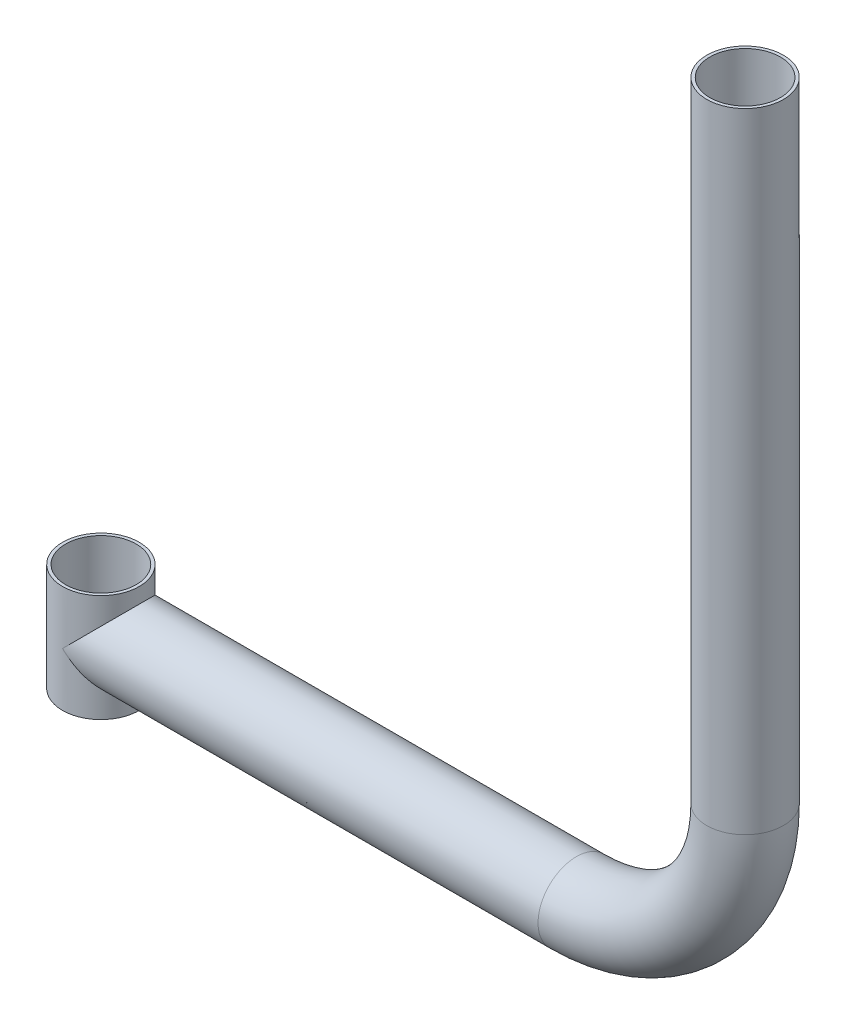
ISO-10303-21;
HEADER;
FILE_DESCRIPTION(('STEP AP214'),'2;1');
FILE_NAME('part.step','',(''),(''),'','','');
FILE_SCHEMA(('AUTOMOTIVE_DESIGN { 1 0 10303 214 1 1 1 1 }'));
ENDSEC;
DATA;
#1=APPLICATION_CONTEXT('core data for automotive mechanical design processes');
#2=APPLICATION_PROTOCOL_DEFINITION('international standard','automotive_design',2000,#1);
#3=PRODUCT_CONTEXT('',#1,'mechanical');
#4=PRODUCT('Part','Part','',(#3));
#5=PRODUCT_RELATED_PRODUCT_CATEGORY('part','',(#4));
#6=PRODUCT_DEFINITION_FORMATION('','',#4);
#7=PRODUCT_DEFINITION_CONTEXT('part definition',#1,'design');
#8=PRODUCT_DEFINITION('design','',#6,#7);
#9=PRODUCT_DEFINITION_SHAPE('','',#8);
#10=(LENGTH_UNIT() NAMED_UNIT(*) SI_UNIT(.MILLI.,.METRE.));
#11=(NAMED_UNIT(*) PLANE_ANGLE_UNIT() SI_UNIT($,.RADIAN.));
#12=(NAMED_UNIT(*) SI_UNIT($,.STERADIAN.) SOLID_ANGLE_UNIT());
#13=UNCERTAINTY_MEASURE_WITH_UNIT(LENGTH_MEASURE(1.E-05),#10,'distance_accuracy_value','');
#14=(GEOMETRIC_REPRESENTATION_CONTEXT(3) GLOBAL_UNCERTAINTY_ASSIGNED_CONTEXT((#13)) GLOBAL_UNIT_ASSIGNED_CONTEXT((#10,
#11,#12)) REPRESENTATION_CONTEXT('',''));
#15=CARTESIAN_POINT('',(0.,0.,0.));
#16=DIRECTION('',(0.,0.,1.));
#17=DIRECTION('',(1.,0.,0.));
#18=AXIS2_PLACEMENT_3D('',#15,#16,#17);
#19=CARTESIAN_POINT('',(0.,17.5,0.));
#20=DIRECTION('',(0.,-1.,0.));
#21=DIRECTION('',(0.,0.,-1.));
#22=AXIS2_PLACEMENT_3D('',#19,#20,#21);
#23=CYLINDRICAL_SURFACE('',#22,12.5);
#24=CARTESIAN_POINT('',(0.,-17.5,0.));
#25=DIRECTION('',(0.,1.,0.));
#26=DIRECTION('',(0.,0.,1.));
#27=AXIS2_PLACEMENT_3D('',#24,#25,#26);
#28=CIRCLE('',#27,12.5);
#29=CARTESIAN_POINT('',(0.,-17.5,12.5));
#30=VERTEX_POINT('',#29);
#31=EDGE_CURVE('E37',#30,#30,#28,.T.);
#32=ORIENTED_EDGE('',*,*,#31,.T.);
#33=EDGE_LOOP('',(#32));
#34=FACE_BOUND('',#33,.T.);
#35=CARTESIAN_POINT('',(0.,17.5,0.));
#36=DIRECTION('',(0.,1.,0.));
#37=DIRECTION('',(0.,0.,1.));
#38=AXIS2_PLACEMENT_3D('',#35,#36,#37);
#39=CIRCLE('',#38,12.5);
#40=CARTESIAN_POINT('',(0.,17.5,12.5));
#41=VERTEX_POINT('',#40);
#42=EDGE_CURVE('E11',#41,#41,#39,.T.);
#43=ORIENTED_EDGE('',*,*,#42,.F.);
#44=EDGE_LOOP('',(#43));
#45=FACE_BOUND('',#44,.T.);
#46=CARTESIAN_POINT('',(0.,0.,0.));
#47=DIRECTION('',(-0.707106781186547,-0.707106781186547,0.));
#48=DIRECTION('',(0.707106781186547,-0.707106781186547,0.));
#49=AXIS2_PLACEMENT_3D('',#46,#47,#48);
#50=ELLIPSE('',#49,17.6776695296637,12.5);
#51=CARTESIAN_POINT('',(0.,0.,12.5));
#52=VERTEX_POINT('',#51);
#53=CARTESIAN_POINT('',(0.,0.,-12.5));
#54=VERTEX_POINT('',#53);
#55=EDGE_CURVE('E49',#52,#54,#50,.F.);
#56=ORIENTED_EDGE('',*,*,#55,.F.);
#57=CARTESIAN_POINT('',(0.,0.,0.));
#58=DIRECTION('',(0.707106781186547,-0.707106781186547,0.));
#59=DIRECTION('',(-0.707106781186547,-0.707106781186547,0.));
#60=AXIS2_PLACEMENT_3D('',#57,#58,#59);
#61=ELLIPSE('',#60,17.6776695296637,12.5);
#62=EDGE_CURVE('E47',#54,#52,#61,.T.);
#63=ORIENTED_EDGE('',*,*,#62,.F.);
#64=EDGE_LOOP('',(#56,#63));
#65=FACE_BOUND('',#64,.T.);
#66=ADVANCED_FACE('F32',(#34,#45,#65),#23,.T.);
#67=CARTESIAN_POINT('',(0.,17.5,0.));
#68=DIRECTION('',(0.,1.,0.));
#69=DIRECTION('',(0.,0.,1.));
#70=AXIS2_PLACEMENT_3D('',#67,#68,#69);
#71=PLANE('',#70);
#72=ORIENTED_EDGE('',*,*,#42,.T.);
#73=EDGE_LOOP('',(#72));
#74=FACE_BOUND('',#73,.T.);
#75=CARTESIAN_POINT('',(0.,17.5,0.));
#76=DIRECTION('',(0.,1.,0.));
#77=DIRECTION('',(0.,0.,1.));
#78=AXIS2_PLACEMENT_3D('',#75,#76,#77);
#79=CIRCLE('',#78,11.5);
#80=CARTESIAN_POINT('',(0.,17.5,11.5));
#81=VERTEX_POINT('',#80);
#82=EDGE_CURVE('E67',#81,#81,#79,.T.);
#83=ORIENTED_EDGE('',*,*,#82,.F.);
#84=EDGE_LOOP('',(#83));
#85=FACE_BOUND('',#84,.T.);
#86=ADVANCED_FACE('F98',(#74,#85),#71,.T.);
#87=CARTESIAN_POINT('',(0.,-17.5,0.));
#88=DIRECTION('',(0.,1.,0.));
#89=DIRECTION('',(0.,0.,1.));
#90=AXIS2_PLACEMENT_3D('',#87,#88,#89);
#91=PLANE('',#90);
#92=ORIENTED_EDGE('',*,*,#31,.F.);
#93=EDGE_LOOP('',(#92));
#94=FACE_BOUND('',#93,.T.);
#95=CARTESIAN_POINT('',(0.,-17.5,0.));
#96=DIRECTION('',(0.,1.,0.));
#97=DIRECTION('',(0.,0.,1.));
#98=AXIS2_PLACEMENT_3D('',#95,#96,#97);
#99=CIRCLE('',#98,11.5);
#100=CARTESIAN_POINT('',(0.,-17.5,11.5));
#101=VERTEX_POINT('',#100);
#102=EDGE_CURVE('E66',#101,#101,#99,.T.);
#103=ORIENTED_EDGE('',*,*,#102,.T.);
#104=EDGE_LOOP('',(#103));
#105=FACE_BOUND('',#104,.T.);
#106=ADVANCED_FACE('F74',(#94,#105),#91,.F.);
#107=CARTESIAN_POINT('',(155.,0.,0.));
#108=DIRECTION('',(-1.,0.,0.));
#109=DIRECTION('',(0.,0.,1.));
#110=AXIS2_PLACEMENT_3D('',#107,#108,#109);
#111=CYLINDRICAL_SURFACE('',#110,11.5);
#112=CARTESIAN_POINT('',(155.,0.,0.));
#113=DIRECTION('',(1.,0.,0.));
#114=DIRECTION('',(0.,0.,-1.));
#115=AXIS2_PLACEMENT_3D('',#112,#113,#114);
#116=CIRCLE('',#115,11.5);
#117=CARTESIAN_POINT('',(154.999999999999,-11.5,0.));
#118=VERTEX_POINT('',#117);
#119=EDGE_CURVE('E139',#118,#118,#116,.T.);
#120=ORIENTED_EDGE('',*,*,#119,.T.);
#121=EDGE_LOOP('',(#120));
#122=FACE_BOUND('',#121,.T.);
#123=CARTESIAN_POINT('',(4.89897948556636,0.,11.5));
#124=CARTESIAN_POINT('',(4.89898687547073,-0.161050714941098,11.499998128947));
#125=CARTESIAN_POINT('',(4.90697813966694,-0.322176004963235,11.4966027371293));
#126=CARTESIAN_POINT('',(4.93837620325656,-0.642708575727259,11.4831491725606));
#127=CARTESIAN_POINT('',(4.96179691291249,-0.802114174173734,11.4730849875782));
#128=CARTESIAN_POINT('',(5.02259742005674,-1.11833648788955,11.4465980320316));
#129=CARTESIAN_POINT('',(5.06003347340364,-1.27514007373364,11.430149626083));
#130=CARTESIAN_POINT('',(5.14676681097267,-1.58471517798801,11.3913583865481));
#131=CARTESIAN_POINT('',(5.19607105766288,-1.73748427096921,11.3690120922243));
#132=CARTESIAN_POINT('',(5.33227309215398,-2.11625704291806,11.3059715642967));
#133=CARTESIAN_POINT('',(5.42544724047777,-2.33940997190162,11.2617576276176));
#134=CARTESIAN_POINT('',(5.62744991669083,-2.77591364007455,11.1621908304903));
#135=CARTESIAN_POINT('',(5.73629055737224,-2.98925662457986,11.1068293378006));
#136=CARTESIAN_POINT('',(5.96502867597921,-3.40768576295589,10.9856836116672));
#137=CARTESIAN_POINT('',(6.08495897623642,-3.61274464631825,10.9198679956927));
#138=CARTESIAN_POINT('',(6.33200766115236,-4.01490639968847,10.7784946043585));
#139=CARTESIAN_POINT('',(6.45912469685261,-4.21201075094599,10.7029386538847));
#140=CARTESIAN_POINT('',(6.707415470669,-4.58332454200366,10.5489406338149));
#141=CARTESIAN_POINT('',(6.82822463697599,-4.75808781043085,10.4712403790351));
#142=CARTESIAN_POINT('',(7.07229253111596,-5.10215445451722,10.3079709264145));
#143=CARTESIAN_POINT('',(7.19555158478182,-5.27145709595743,10.2224006763069));
#144=CARTESIAN_POINT('',(7.56732196696402,-5.77187771249151,9.95384278397825));
#145=CARTESIAN_POINT('',(7.81772767084005,-6.09536428222405,9.75906809975432));
#146=CARTESIAN_POINT('',(8.31597592337605,-6.72245115016219,9.33814656598695));
#147=CARTESIAN_POINT('',(8.56382117893503,-7.02607476524667,9.11203750886328));
#148=CARTESIAN_POINT('',(9.05165796215988,-7.61308864696441,8.62760439001121));
#149=CARTESIAN_POINT('',(9.29165369583881,-7.89648984887659,8.36929794982774));
#150=CARTESIAN_POINT('',(9.69944261344901,-8.37197840839213,7.88944124621889));
#151=CARTESIAN_POINT('',(9.87010734353275,-8.56899215672874,7.67519003088859));
#152=CARTESIAN_POINT('',(10.202094641417,-8.94937798788239,7.22805483312078));
#153=CARTESIAN_POINT('',(10.3634172919888,-9.13275019156844,6.9951710158128));
#154=CARTESIAN_POINT('',(10.6741870295864,-9.48393038355601,6.51109436548971));
#155=CARTESIAN_POINT('',(10.8236505788622,-9.6517600034736,6.25992787500952));
#156=CARTESIAN_POINT('',(11.1084865019469,-9.97013177413841,5.73929556202502));
#157=CARTESIAN_POINT('',(11.2438620374257,-10.1206778045013,5.46983386790782));
#158=CARTESIAN_POINT('',(11.4721984543046,-10.3737008945038,4.96972646273325));
#159=CARTESIAN_POINT('',(11.568198005625,-10.4797395753268,4.74226476946735));
#160=CARTESIAN_POINT('',(11.7482113699604,-10.6781182124875,4.27688451652436));
#161=CARTESIAN_POINT('',(11.8322278277428,-10.770461191759,4.03896827946154));
#162=CARTESIAN_POINT('',(11.986910530654,-10.9401664397766,3.55370238867579));
#163=CARTESIAN_POINT('',(12.0575809495177,-11.017533392197,3.30635571333425));
#164=CARTESIAN_POINT('',(12.1843204403249,-11.156094705046,2.80349019348776));
#165=CARTESIAN_POINT('',(12.2403893540418,-11.2172888902215,2.54797126045937));
#166=CARTESIAN_POINT('',(12.3371204858404,-11.3227641256212,2.02871018877128));
#167=CARTESIAN_POINT('',(12.3776756184755,-11.3669276362021,1.76492402766838));
#168=CARTESIAN_POINT('',(12.4419371340211,-11.43686979282,1.23287897056051));
#169=CARTESIAN_POINT('',(12.4656434703678,-11.4626483880478,0.964620062196632));
#170=CARTESIAN_POINT('',(12.495645990742,-11.4952690165045,0.426073463036318));
#171=CARTESIAN_POINT('',(12.5019482947592,-11.502117706285,0.155786518915252));
#172=CARTESIAN_POINT('',(12.497006192477,-11.4967458624833,-0.384422796799358));
#173=CARTESIAN_POINT('',(12.4857632352727,-11.4845269037328,-0.654345196658472));
#174=CARTESIAN_POINT('',(12.4481528354092,-11.4436254856433,-1.1624273349759));
#175=CARTESIAN_POINT('',(12.4235450357872,-11.4168582309481,-1.40087651423709));
#176=CARTESIAN_POINT('',(12.3610430170978,-11.3488134031408,-1.87390516554496));
#177=CARTESIAN_POINT('',(12.3231499589664,-11.3075370979052,-2.10848497384287));
#178=CARTESIAN_POINT('',(12.2347354521912,-11.2111159671172,-2.57235513712152));
#179=CARTESIAN_POINT('',(12.1842130036516,-11.1559700434753,-2.80164507172086));
#180=CARTESIAN_POINT('',(12.0713591688217,-11.0326031737016,-3.25370120963636));
#181=CARTESIAN_POINT('',(12.0090270912403,-10.9643814621599,-3.47646703017375));
#182=CARTESIAN_POINT('',(11.8705807408609,-10.8125713078652,-3.92383200811826));
#183=CARTESIAN_POINT('',(11.7939915011827,-10.7284509621474,-4.14810304529409));
#184=CARTESIAN_POINT('',(11.6300610807104,-10.5479735344468,-4.58767171451829));
#185=CARTESIAN_POINT('',(11.5427164497142,-10.4516125254896,-4.80296643726919));
#186=CARTESIAN_POINT('',(11.3584062181262,-10.2476971127943,-5.22392642907384));
#187=CARTESIAN_POINT('',(11.261439767047,-10.1401417195264,-5.42959084452084));
#188=CARTESIAN_POINT('',(11.0589931923798,-9.91482593179784,-5.83088305795222));
#189=CARTESIAN_POINT('',(10.953512123444,-9.79706440407912,-6.02650973752764));
#190=CARTESIAN_POINT('',(10.6776085306931,-9.48780644512488,-6.50776096124053));
#191=CARTESIAN_POINT('',(10.5022149153422,-9.29011163816472,-6.7865890268831));
#192=CARTESIAN_POINT('',(10.1376201357452,-8.87586730438183,-7.32004803092958));
#193=CARTESIAN_POINT('',(9.94841707388713,-8.65931518550715,-7.57467563274051));
#194=CARTESIAN_POINT('',(9.55891227170324,-8.20887672790055,-8.06067222124523));
#195=CARTESIAN_POINT('',(9.35857962638402,-7.97494144265216,-8.29197084908409));
#196=CARTESIAN_POINT('',(8.95054525301139,-7.49192811234575,-8.73083579864401));
#197=CARTESIAN_POINT('',(8.74284487727575,-7.24285284024494,-8.93840644631062));
#198=CARTESIAN_POINT('',(8.31806142484458,-6.72405590760965,-9.33522279099068));
#199=CARTESIAN_POINT('',(8.1008734225098,-6.45397521683364,-9.52388570495906));
#200=CARTESIAN_POINT('',(7.66592878136406,-5.89884032510975,-9.8773500349799));
#201=CARTESIAN_POINT('',(7.44817194540539,-5.61378001091634,-10.0421416043458));
#202=CARTESIAN_POINT('',(7.01768541742546,-5.02863648875022,-10.3475364573665));
#203=CARTESIAN_POINT('',(6.80494444090452,-4.72859294427691,-10.4881996427082));
#204=CARTESIAN_POINT('',(6.39112200466379,-4.11087361697843,-10.7453547183043));
#205=CARTESIAN_POINT('',(6.19002952446975,-3.79321507549507,-10.8618697330784));
#206=CARTESIAN_POINT('',(5.83810792419264,-3.18371962110321,-11.0544453529163));
#207=CARTESIAN_POINT('',(5.68421267924375,-2.89476796631387,-11.1339170724581));
#208=CARTESIAN_POINT('',(5.40499287174953,-2.29854308748267,-11.2720982029706));
#209=CARTESIAN_POINT('',(5.27963024618152,-1.99129497024341,-11.3308353326125));
#210=CARTESIAN_POINT('',(5.09287423096793,-1.4133985350198,-11.415844125629));
#211=CARTESIAN_POINT('',(5.02410089051111,-1.14584259189194,-11.4460130027346));
#212=CARTESIAN_POINT('',(4.95247276201405,-0.738225702055074,-11.4770921434419));
#213=CARTESIAN_POINT('',(4.93385419026909,-0.601410375894931,-11.4850888020826));
#214=CARTESIAN_POINT('',(4.90794414368101,-0.326487474449195,-11.4961863057685));
#215=CARTESIAN_POINT('',(4.90065211800655,-0.188379962333682,-11.4992873888948));
#216=CARTESIAN_POINT('',(4.89781609621938,0.0884821772971746,-11.5004956679116));
#217=CARTESIAN_POINT('',(4.90231474860417,0.227237336804015,-11.4985847346345));
#218=CARTESIAN_POINT('',(4.92287050908509,0.503697212373779,-11.4897978680586));
#219=CARTESIAN_POINT('',(4.93892803265257,0.641401890498459,-11.4829217562918));
#220=CARTESIAN_POINT('',(5.0033743321431,1.05193755174673,-11.4550655719315));
#221=CARTESIAN_POINT('',(5.06803728544576,1.3218297760185,-11.4268567940886));
#222=CARTESIAN_POINT('',(5.21149593035029,1.78813018458343,-11.3619931611251));
#223=CARTESIAN_POINT('',(5.28366715870774,1.98721614504941,-11.3287503263076));
#224=CARTESIAN_POINT('',(5.44263143335629,2.3778132194689,-11.2532451251904));
#225=CARTESIAN_POINT('',(5.52943458144902,2.56931898652808,-11.2109765221314));
#226=CARTESIAN_POINT('',(5.71399448175805,2.94563320809442,-11.1180472586453));
#227=CARTESIAN_POINT('',(5.81178834041665,3.13041600638476,-11.067357875138));
#228=CARTESIAN_POINT('',(6.01507472283465,3.49338123328425,-10.9582025067598));
#229=CARTESIAN_POINT('',(6.12057015763763,3.67156112736004,-10.8997335744326));
#230=CARTESIAN_POINT('',(6.33639866038959,4.02103743234971,-10.7756886421296));
#231=CARTESIAN_POINT('',(6.44670436225923,4.19236427189973,-10.7101503441168));
#232=CARTESIAN_POINT('',(6.67098309654928,4.52966096540773,-10.5719143056716));
#233=CARTESIAN_POINT('',(6.78495677588085,4.69562986394612,-10.4992152976139));
#234=CARTESIAN_POINT('',(7.13050195603415,5.1863670598243,-10.2704484627847));
#235=CARTESIAN_POINT('',(7.36558503462184,5.50378925727005,-10.1037741085232));
#236=CARTESIAN_POINT('',(7.83738405429405,6.12076532297191,-9.74237742866567));
#237=CARTESIAN_POINT('',(8.07409982094008,6.42032106809488,-9.54765805655716));
#238=CARTESIAN_POINT('',(8.54377930372247,7.00182133319181,-9.12976396653465));
#239=CARTESIAN_POINT('',(8.77674473671805,7.28377409218957,-8.90660271178787));
#240=CARTESIAN_POINT('',(9.19972720833235,7.78785763418102,-8.46719771040084));
#241=CARTESIAN_POINT('',(9.39090116423714,8.01257750923726,-8.25503390492284));
#242=CARTESIAN_POINT('',(9.76469738674804,8.44758518267198,-7.80930685823016));
#243=CARTESIAN_POINT('',(9.94731902963564,8.65787192896433,-7.57574205990647));
#244=CARTESIAN_POINT('',(10.3009403926557,9.061947757436,-7.08740871318655));
#245=CARTESIAN_POINT('',(10.4719596814031,9.25576476449016,-6.83267756485498));
#246=CARTESIAN_POINT('',(10.7997829916574,9.62509952596485,-6.30174148200565));
#247=CARTESIAN_POINT('',(10.9565922258827,9.80062399426815,-6.02554449150241));
#248=CARTESIAN_POINT('',(11.2179817515655,10.0918879654816,-5.51975922373696));
#249=CARTESIAN_POINT('',(11.3261627721092,10.2119695431636,-5.29452222302423));
#250=CARTESIAN_POINT('',(11.5309056463323,10.4385892067585,-4.83239356415985));
#251=CARTESIAN_POINT('',(11.6274741689099,10.545135068052,-4.59550870641291));
#252=CARTESIAN_POINT('',(11.8075486654861,10.7433664110982,-4.11079388358198));
#253=CARTESIAN_POINT('',(11.8910555453675,10.8350529234286,-3.86296467906701));
#254=CARTESIAN_POINT('',(12.0435383268843,11.0021809634364,-3.35750733945077));
#255=CARTESIAN_POINT('',(12.1125140256028,11.0776222642619,-3.09987906757223));
#256=CARTESIAN_POINT('',(12.2350544415523,11.2114802371808,-2.57426529928759));
#257=CARTESIAN_POINT('',(12.2884887959589,11.2697529468644,-2.30621243615065));
#258=CARTESIAN_POINT('',(12.3779880039751,11.3672759598111,-1.76379030075867));
#259=CARTESIAN_POINT('',(12.4140528058244,11.4065262063886,-1.48942100968363));
#260=CARTESIAN_POINT('',(12.4679238735094,11.4651323139446,-0.936941815429361));
#261=CARTESIAN_POINT('',(12.4857408371337,11.4844998311819,-0.658834200845877));
#262=CARTESIAN_POINT('',(12.5026975752214,11.5029326980903,-0.101393211070279));
#263=CARTESIAN_POINT('',(12.5018395179428,11.5020004046653,0.177940018057065));
#264=CARTESIAN_POINT('',(12.4827672929756,11.4812669563771,0.699925113261697));
#265=CARTESIAN_POINT('',(12.4667562048329,11.463860891734,0.942759167618235));
#266=CARTESIAN_POINT('',(12.4208172420688,11.4138862017807,1.42550769397818));
#267=CARTESIAN_POINT('',(12.3908907818161,11.3813191174472,1.66542246015768));
#268=CARTESIAN_POINT('',(12.3176744816862,11.3015642393651,2.1407307991588));
#269=CARTESIAN_POINT('',(12.2743841551395,11.2543759131571,2.37612420699529));
#270=CARTESIAN_POINT('',(12.1751933112679,11.1461115432759,2.84097860156579));
#271=CARTESIAN_POINT('',(12.1192921531647,11.0850347939066,3.07043928618725));
#272=CARTESIAN_POINT('',(11.994964578962,10.9489702408972,3.52521321342218));
#273=CARTESIAN_POINT('',(11.9263831073054,10.8738100517616,3.75043222445788));
#274=CARTESIAN_POINT('',(11.7781931330006,10.7110674028921,4.19268210703811));
#275=CARTESIAN_POINT('',(11.6985804177752,10.6234801972601,4.40970981003325));
#276=CARTESIAN_POINT('',(11.529402669621,10.4368901300052,4.83479134974706));
#277=CARTESIAN_POINT('',(11.4398369855933,10.3378865215334,5.04284459814165));
#278=CARTESIAN_POINT('',(11.251808535832,10.1294234255294,5.44949658673558));
#279=CARTESIAN_POINT('',(11.1533438885123,10.0199617264702,5.64809331384212));
#280=CARTESIAN_POINT('',(10.8977870789843,9.73486093567296,6.13152420975689));
#281=CARTESIAN_POINT('',(10.7358214621247,9.55330754529369,6.41032549853229));
#282=CARTESIAN_POINT('',(10.3975531977266,9.17152955735848,6.94558987822857));
#283=CARTESIAN_POINT('',(10.221244522879,8.97129710515767,7.20204348336036));
#284=CARTESIAN_POINT('',(9.85698826790956,8.55398269579396,7.69307546008197));
#285=CARTESIAN_POINT('',(9.66901737839877,8.33686675878136,7.92760750925563));
#286=CARTESIAN_POINT('',(9.28467936161992,7.88788655528294,8.37445922765048));
#287=CARTESIAN_POINT('',(9.0883133918574,7.65602431986653,8.58678194524771));
#288=CARTESIAN_POINT('',(8.68531819020779,7.17306839441962,8.99440298928941));
#289=CARTESIAN_POINT('',(8.47855628735832,6.9216513896794,9.18918585732347));
#290=CARTESIAN_POINT('',(8.06232759553174,6.40504511225322,9.55645791294846));
#291=CARTESIAN_POINT('',(7.85286020695987,6.13985274588527,9.72894206206572));
#292=CARTESIAN_POINT('',(7.43528061619216,5.59587261598335,10.0516734566371));
#293=CARTESIAN_POINT('',(7.22716710435726,5.31710130033501,10.2019467568244));
#294=CARTESIAN_POINT('',(6.81697912916304,4.74461044073653,10.4804601816031));
#295=CARTESIAN_POINT('',(6.61490162206504,4.45089863983587,10.6087115714535));
#296=CARTESIAN_POINT('',(6.31626579520195,3.98872406967352,10.7874628753249));
#297=CARTESIAN_POINT('',(6.21487970930982,3.82650251548467,10.8461106406693));
#298=CARTESIAN_POINT('',(6.01742809739356,3.49670403918121,10.9568856156582));
#299=CARTESIAN_POINT('',(5.92136141916834,3.32912828930238,11.0090142404727));
#300=CARTESIAN_POINT('',(5.73656621153711,2.98809235522164,11.1064265952979));
#301=CARTESIAN_POINT('',(5.64783419342118,2.81463502459067,11.1517135880939));
#302=CARTESIAN_POINT('',(5.48033591286551,2.46136439338965,11.2349750932121));
#303=CARTESIAN_POINT('',(5.40156634983256,2.28155322325912,11.2729520295672));
#304=CARTESIAN_POINT('',(5.22216722851541,1.82578964665572,11.3575094376127));
#305=CARTESIAN_POINT('',(5.12950352372435,1.54556137013475,11.3993091164748));
#306=CARTESIAN_POINT('',(5.02259951530565,1.11610771523456,11.4466161892325));
#307=CARTESIAN_POINT('',(4.99233324186775,0.971644178288444,11.4598121352095));
#308=CARTESIAN_POINT('',(4.94391681635751,0.680344096791332,11.480783646627));
#309=CARTESIAN_POINT('',(4.92575721115924,0.533509495592051,11.4885634413159));
#310=CARTESIAN_POINT('',(4.90912520612383,0.321909516480606,11.4956736718879));
#311=CARTESIAN_POINT('',(4.90532606575551,0.257600504845143,11.4972946830357));
#312=CARTESIAN_POINT('',(4.90025171262072,0.128864975946772,11.499458227586));
#313=CARTESIAN_POINT('',(4.89897652877081,0.0644384573460696,11.5000007486323));
#314=CARTESIAN_POINT('',(4.89897948556636,0.,11.5));
#315=B_SPLINE_CURVE_WITH_KNOTS('',3,(#123,#124,#125,#126,#127,#128,#129,#130,#131,#132,#133,
#134,#135,#136,#137,#138,#139,#140,#141,#142,#143,#144,#145,#146,#147,#148,#149,#150,#151,#152,
#153,#154,#155,#156,#157,#158,#159,#160,#161,#162,#163,#164,#165,#166,#167,#168,#169,#170,#171,
#172,#173,#174,#175,#176,#177,#178,#179,#180,#181,#182,#183,#184,#185,#186,#187,#188,#189,#190,
#191,#192,#193,#194,#195,#196,#197,#198,#199,#200,#201,#202,#203,#204,#205,#206,#207,#208,#209,
#210,#211,#212,#213,#214,#215,#216,#217,#218,#219,#220,#221,#222,#223,#224,#225,#226,#227,#228,
#229,#230,#231,#232,#233,#234,#235,#236,#237,#238,#239,#240,#241,#242,#243,#244,#245,#246,#247,
#248,#249,#250,#251,#252,#253,#254,#255,#256,#257,#258,#259,#260,#261,#262,#263,#264,#265,#266,
#267,#268,#269,#270,#271,#272,#273,#274,#275,#276,#277,#278,#279,#280,#281,#282,#283,#284,#285,
#286,#287,#288,#289,#290,#291,#292,#293,#294,#295,#296,#297,#298,#299,#300,#301,#302,#303,#304,
#305,#306,#307,#308,#309,#310,#311,#312,#313,#314),.UNSPECIFIED.,.T.,.F.,(4,2,2,2,2,2,2,2,2,2,2,
2,2,2,2,2,2,2,2,2,2,2,2,2,2,2,2,2,2,2,2,2,2,2,2,2,2,2,2,2,2,2,2,2,2,2,2,2,2,2,2,2,2,2,2,2,2,2,2,
2,2,2,2,2,2,2,2,2,2,2,2,2,2,2,2,2,2,2,2,2,2,2,2,2,2,2,2,2,2,2,2,2,2,2,2,4),(0.,0.48305742701083,
0.966550946680514,1.45200632705651,1.93774719658965,2.67392368998395,3.41067245790235,
4.14967621237442,4.88854171257002,5.56695990928025,6.24546894692002,7.60303962889337,
8.9589869675508,10.3141954315599,11.3256085683402,12.3370127425677,13.3469874333181,
14.3567349718005,15.1620856155633,15.9672582358442,16.7721786342925,17.5771077547471,
18.3874968164959,19.1978881178503,20.0079944152322,20.8180338080061,21.5408169251888,
22.2635368975063,22.9863141072434,23.7091336387044,24.462827528407,25.2167638271269,
25.9707668268943,26.7248536563877,27.8756562315141,29.0266172418901,30.180951738014,
31.3350754458943,32.5178480325843,33.7011071200779,34.881384713855,36.0605267862776,
37.0695745827567,38.0772682970569,38.9073740574791,39.3218106419738,39.736227071003,
40.1521445680024,40.5680770154609,41.401007755513,42.0432530274323,42.6859435319737,
43.3308730289092,43.976047571331,44.6179371559762,45.2599405761174,46.5446016171209,
47.8291274662064,49.1130475185811,50.2023291280385,51.2916900552685,52.3791654705167,
53.4662403351291,54.2971831379788,55.1276464394462,55.9580521190428,56.7884693938575,
57.6256636985551,58.4628604980244,59.2995662097353,60.1361747764819,60.8672474936228,
61.5982459202287,62.329270970608,63.0603331740072,63.8010098361672,64.5419701291906,
65.2829789225809,66.0241447621807,67.1325851815353,68.2414938252787,69.3526950963269,
70.4637436470435,71.6008248564021,72.7381625458529,73.8741552928361,75.0095651827474,
75.6096262998492,76.2095569291868,76.8092005412818,77.4086449662137,78.2992522656943,
78.7433283220322,79.1870572276246,79.3803324875405,79.5736099617667),.UNSPECIFIED.);
#316=CARTESIAN_POINT('',(4.89897948556636,0.,11.5));
#317=VERTEX_POINT('',#316);
#318=EDGE_CURVE('E51',#317,#317,#315,.T.);
#319=ORIENTED_EDGE('',*,*,#318,.F.);
#320=EDGE_LOOP('',(#319));
#321=FACE_BOUND('',#320,.T.);
#322=ADVANCED_FACE('F69',(#122,#321),#111,.F.);
#323=CARTESIAN_POINT('',(155.,0.,0.));
#324=DIRECTION('',(-1.,0.,0.));
#325=DIRECTION('',(0.,0.,1.));
#326=AXIS2_PLACEMENT_3D('',#323,#324,#325);
#327=CYLINDRICAL_SURFACE('',#326,12.5);
#328=CARTESIAN_POINT('',(155.,0.,0.));
#329=DIRECTION('',(1.,0.,0.));
#330=DIRECTION('',(0.,0.,-1.));
#331=AXIS2_PLACEMENT_3D('',#328,#329,#330);
#332=CIRCLE('',#331,12.5);
#333=CARTESIAN_POINT('',(154.999999999999,-12.5,0.));
#334=VERTEX_POINT('',#333);
#335=EDGE_CURVE('E136',#334,#334,#332,.T.);
#336=ORIENTED_EDGE('',*,*,#335,.F.);
#337=EDGE_LOOP('',(#336));
#338=FACE_BOUND('',#337,.T.);
#339=ORIENTED_EDGE('',*,*,#62,.T.);
#340=ORIENTED_EDGE('',*,*,#55,.T.);
#341=EDGE_LOOP('',(#339,#340));
#342=FACE_BOUND('',#341,.T.);
#343=ADVANCED_FACE('F53',(#338,#342),#327,.T.);
#344=CARTESIAN_POINT('',(210.,55.0000000000004,0.));
#345=DIRECTION('',(0.,1.,0.));
#346=DIRECTION('',(0.,0.,1.));
#347=AXIS2_PLACEMENT_3D('',#344,#345,#346);
#348=CYLINDRICAL_SURFACE('',#347,12.5);
#349=CARTESIAN_POINT('',(210.,55.0000000000004,0.));
#350=DIRECTION('',(0.,1.,0.));
#351=DIRECTION('',(0.,0.,-1.));
#352=AXIS2_PLACEMENT_3D('',#349,#350,#351);
#353=CIRCLE('',#352,12.5);
#354=CARTESIAN_POINT('',(222.5,55.0000000000005,0.));
#355=VERTEX_POINT('',#354);
#356=EDGE_CURVE('E129',#355,#355,#353,.T.);
#357=ORIENTED_EDGE('',*,*,#356,.T.);
#358=EDGE_LOOP('',(#357));
#359=FACE_BOUND('',#358,.T.);
#360=CARTESIAN_POINT('',(210.,260.,0.));
#361=DIRECTION('',(0.,1.,0.));
#362=DIRECTION('',(0.,0.,-1.));
#363=AXIS2_PLACEMENT_3D('',#360,#361,#362);
#364=CIRCLE('',#363,12.5);
#365=CARTESIAN_POINT('',(210.,260.,-12.5));
#366=VERTEX_POINT('',#365);
#367=EDGE_CURVE('E54',#366,#366,#364,.T.);
#368=ORIENTED_EDGE('',*,*,#367,.F.);
#369=EDGE_LOOP('',(#368));
#370=FACE_BOUND('',#369,.T.);
#371=ADVANCED_FACE('F89',(#359,#370),#348,.T.);
#372=CARTESIAN_POINT('',(210.,55.0000000000004,0.));
#373=DIRECTION('',(0.,1.,0.));
#374=DIRECTION('',(0.,0.,1.));
#375=AXIS2_PLACEMENT_3D('',#372,#373,#374);
#376=CYLINDRICAL_SURFACE('',#375,11.5);
#377=CARTESIAN_POINT('',(210.,55.0000000000004,0.));
#378=DIRECTION('',(0.,1.,0.));
#379=DIRECTION('',(0.,0.,-1.));
#380=AXIS2_PLACEMENT_3D('',#377,#378,#379);
#381=CIRCLE('',#380,11.5);
#382=CARTESIAN_POINT('',(221.5,55.0000000000005,0.));
#383=VERTEX_POINT('',#382);
#384=EDGE_CURVE('E131',#383,#383,#381,.T.);
#385=ORIENTED_EDGE('',*,*,#384,.F.);
#386=EDGE_LOOP('',(#385));
#387=FACE_BOUND('',#386,.T.);
#388=CARTESIAN_POINT('',(210.,260.,0.));
#389=DIRECTION('',(0.,1.,0.));
#390=DIRECTION('',(0.,0.,-1.));
#391=AXIS2_PLACEMENT_3D('',#388,#389,#390);
#392=CIRCLE('',#391,11.5);
#393=CARTESIAN_POINT('',(210.,260.,-11.5));
#394=VERTEX_POINT('',#393);
#395=EDGE_CURVE('E57',#394,#394,#392,.T.);
#396=ORIENTED_EDGE('',*,*,#395,.T.);
#397=EDGE_LOOP('',(#396));
#398=FACE_BOUND('',#397,.T.);
#399=ADVANCED_FACE('F85',(#387,#398),#376,.F.);
#400=CARTESIAN_POINT('',(155.,55.,0.));
#401=DIRECTION('',(0.,0.,1.));
#402=DIRECTION('',(1.,0.,0.));
#403=AXIS2_PLACEMENT_3D('',#400,#401,#402);
#404=TOROIDAL_SURFACE('',#403,55.,12.5);
#405=CARTESIAN_POINT('',(155.,55.,0.));
#406=DIRECTION('',(0.,0.,1.));
#407=DIRECTION('',(1.,0.,0.));
#408=AXIS2_PLACEMENT_3D('',#405,#406,#407);
#409=CIRCLE('',#408,67.5);
#410=EDGE_CURVE('',#334,#355,#409,.T.);
#411=ORIENTED_EDGE('',*,*,#335,.T.);
#412=ORIENTED_EDGE('',*,*,#356,.F.);
#413=ORIENTED_EDGE('',*,*,#410,.T.);
#414=ORIENTED_EDGE('',*,*,#410,.F.);
#415=EDGE_LOOP('',(#411,#413,#412,#414));
#416=FACE_BOUND('',#415,.T.);
#417=ADVANCED_FACE('F81',(#416),#404,.T.);
#418=CARTESIAN_POINT('',(155.,55.,0.));
#419=DIRECTION('',(0.,0.,1.));
#420=DIRECTION('',(1.,0.,0.));
#421=AXIS2_PLACEMENT_3D('',#418,#419,#420);
#422=TOROIDAL_SURFACE('',#421,55.,11.5);
#423=CARTESIAN_POINT('',(155.,55.,0.));
#424=DIRECTION('',(0.,0.,1.));
#425=DIRECTION('',(1.,0.,0.));
#426=AXIS2_PLACEMENT_3D('',#423,#424,#425);
#427=CIRCLE('',#426,66.5);
#428=EDGE_CURVE('',#118,#383,#427,.T.);
#429=ORIENTED_EDGE('',*,*,#119,.F.);
#430=ORIENTED_EDGE('',*,*,#384,.T.);
#431=ORIENTED_EDGE('',*,*,#428,.T.);
#432=ORIENTED_EDGE('',*,*,#428,.F.);
#433=EDGE_LOOP('',(#429,#431,#430,#432));
#434=FACE_BOUND('',#433,.T.);
#435=ADVANCED_FACE('F77',(#434),#422,.F.);
#436=CARTESIAN_POINT('',(210.,260.,0.));
#437=DIRECTION('',(0.,1.,0.));
#438=DIRECTION('',(0.,0.,-1.));
#439=AXIS2_PLACEMENT_3D('',#436,#437,#438);
#440=PLANE('',#439);
#441=ORIENTED_EDGE('',*,*,#395,.F.);
#442=EDGE_LOOP('',(#441));
#443=FACE_BOUND('',#442,.T.);
#444=ORIENTED_EDGE('',*,*,#367,.T.);
#445=EDGE_LOOP('',(#444));
#446=FACE_BOUND('',#445,.T.);
#447=ADVANCED_FACE('F80',(#443,#446),#440,.T.);
#448=ORIENTED_EDGE('',*,*,#318,.T.);
#449=EDGE_LOOP('',(#448));
#450=FACE_BOUND('',#449,.T.);
#451=ADVANCED_FACE('F34',(#450),#23,.T.);
#452=CARTESIAN_POINT('',(0.,17.5,0.));
#453=DIRECTION('',(0.,-1.,0.));
#454=DIRECTION('',(0.,0.,-1.));
#455=AXIS2_PLACEMENT_3D('',#452,#453,#454);
#456=CYLINDRICAL_SURFACE('',#455,11.5);
#457=ORIENTED_EDGE('',*,*,#102,.F.);
#458=EDGE_LOOP('',(#457));
#459=FACE_BOUND('',#458,.T.);
#460=ORIENTED_EDGE('',*,*,#82,.T.);
#461=EDGE_LOOP('',(#460));
#462=FACE_BOUND('',#461,.T.);
#463=ADVANCED_FACE('F94',(#459,#462),#456,.F.);
#464=CLOSED_SHELL('',(#66,#86,#106,#322,#343,#371,#399,#417,#435,#447,#451,#463));
#465=MANIFOLD_SOLID_BREP('B2',#464);
#466=ADVANCED_BREP_SHAPE_REPRESENTATION('',(#18,#465),#14);
#467=SHAPE_DEFINITION_REPRESENTATION(#9,#466);
ENDSEC;
END-ISO-10303-21;
